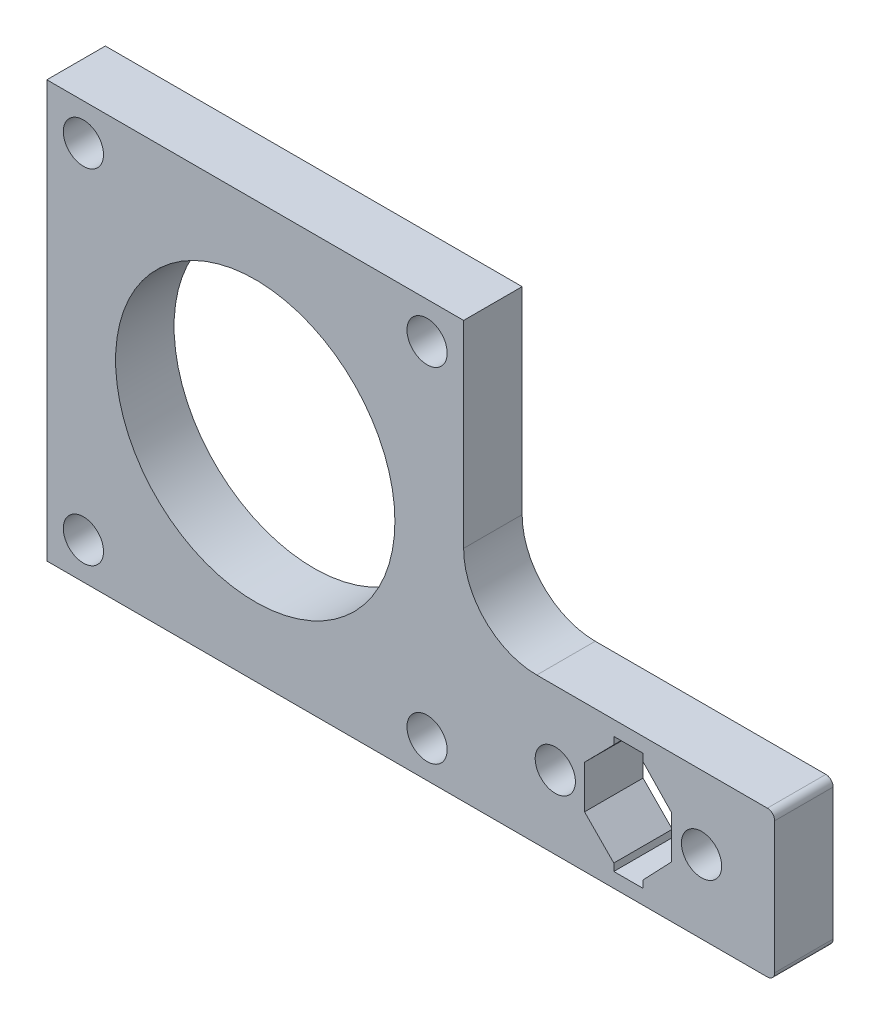
ISO-10303-21;
HEADER;
FILE_DESCRIPTION(('STEP AP214'),'2;1');
FILE_NAME('part.step','',(''),(''),'','','');
FILE_SCHEMA(('AUTOMOTIVE_DESIGN { 1 0 10303 214 1 1 1 1 }'));
ENDSEC;
DATA;
#1=APPLICATION_CONTEXT('core data for automotive mechanical design processes');
#2=APPLICATION_PROTOCOL_DEFINITION('international standard','automotive_design',2000,#1);
#3=PRODUCT_CONTEXT('',#1,'mechanical');
#4=PRODUCT('Part','Part','',(#3));
#5=PRODUCT_RELATED_PRODUCT_CATEGORY('part','',(#4));
#6=PRODUCT_DEFINITION_FORMATION('','',#4);
#7=PRODUCT_DEFINITION_CONTEXT('part definition',#1,'design');
#8=PRODUCT_DEFINITION('design','',#6,#7);
#9=PRODUCT_DEFINITION_SHAPE('','',#8);
#10=(LENGTH_UNIT() NAMED_UNIT(*) SI_UNIT(.MILLI.,.METRE.));
#11=(NAMED_UNIT(*) PLANE_ANGLE_UNIT() SI_UNIT($,.RADIAN.));
#12=(NAMED_UNIT(*) SI_UNIT($,.STERADIAN.) SOLID_ANGLE_UNIT());
#13=UNCERTAINTY_MEASURE_WITH_UNIT(LENGTH_MEASURE(1.E-05),#10,'distance_accuracy_value','');
#14=(GEOMETRIC_REPRESENTATION_CONTEXT(3) GLOBAL_UNCERTAINTY_ASSIGNED_CONTEXT((#13)) GLOBAL_UNIT_ASSIGNED_CONTEXT((#10,
#11,#12)) REPRESENTATION_CONTEXT('',''));
#15=CARTESIAN_POINT('',(0.,0.,0.));
#16=DIRECTION('',(0.,0.,1.));
#17=DIRECTION('',(1.,0.,0.));
#18=AXIS2_PLACEMENT_3D('',#15,#16,#17);
#19=CARTESIAN_POINT('',(14.9833392850546,-14.7619106256692,-8.));
#20=DIRECTION('',(0.712350865959975,-0.701823513261044,0.));
#21=DIRECTION('',(0.701823513261044,0.712350865959975,0.));
#22=AXIS2_PLACEMENT_3D('',#19,#20,#21);
#23=PLANE('',#22);
#24=DIRECTION('',(0.701823513261044,0.712350865959975,0.));
#25=VECTOR('',#24,1.);
#26=CARTESIAN_POINT('',(14.9833392850546,-14.7619106256692,0.));
#27=LINE('',#26,#25);
#28=CARTESIAN_POINT('',(-6.00000000000003,-36.0600000000001,0.));
#29=VERTEX_POINT('',#28);
#30=CARTESIAN_POINT('',(-2.,-32.,0.));
#31=VERTEX_POINT('',#30);
#32=EDGE_CURVE('E273',#29,#31,#27,.T.);
#33=ORIENTED_EDGE('',*,*,#32,.F.);
#34=DIRECTION('',(0.,0.,1.));
#35=VECTOR('',#34,1.);
#36=CARTESIAN_POINT('',(-6.00000000000003,-36.0600000000001,-8.));
#37=LINE('',#36,#35);
#38=CARTESIAN_POINT('',(-6.00000000000003,-36.0600000000001,-8.));
#39=VERTEX_POINT('',#38);
#40=EDGE_CURVE('E308',#39,#29,#37,.T.);
#41=ORIENTED_EDGE('',*,*,#40,.F.);
#42=DIRECTION('',(0.701823513261044,0.712350865959975,0.));
#43=VECTOR('',#42,1.);
#44=CARTESIAN_POINT('',(14.9833392850546,-14.7619106256692,-8.));
#45=LINE('',#44,#43);
#46=CARTESIAN_POINT('',(-2.,-32.,-8.));
#47=VERTEX_POINT('',#46);
#48=EDGE_CURVE('E220',#39,#47,#45,.T.);
#49=ORIENTED_EDGE('',*,*,#48,.T.);
#50=DIRECTION('',(0.,0.,1.));
#51=VECTOR('',#50,1.);
#52=CARTESIAN_POINT('',(-2.,-32.,-8.));
#53=LINE('',#52,#51);
#54=EDGE_CURVE('E331',#47,#31,#53,.T.);
#55=ORIENTED_EDGE('',*,*,#54,.T.);
#56=EDGE_LOOP('',(#33,#41,#49,#55));
#57=FACE_BOUND('',#56,.T.);
#58=ADVANCED_FACE('F35',(#57),#23,.T.);
#59=CARTESIAN_POINT('',(-6.00000000000011,0.,-8.));
#60=DIRECTION('',(1.,0.,0.));
#61=DIRECTION('',(0.,1.,0.));
#62=AXIS2_PLACEMENT_3D('',#59,#60,#61);
#63=PLANE('',#62);
#64=DIRECTION('',(0.,1.,0.));
#65=VECTOR('',#64,1.);
#66=CARTESIAN_POINT('',(-6.00000000000011,0.,0.));
#67=LINE('',#66,#65);
#68=CARTESIAN_POINT('',(-6.00000000000003,-41.9400000000002,0.));
#69=VERTEX_POINT('',#68);
#70=EDGE_CURVE('E208',#69,#29,#67,.T.);
#71=ORIENTED_EDGE('',*,*,#70,.F.);
#72=DIRECTION('',(0.,0.,1.));
#73=VECTOR('',#72,1.);
#74=CARTESIAN_POINT('',(-6.00000000000003,-41.9400000000002,-8.));
#75=LINE('',#74,#73);
#76=CARTESIAN_POINT('',(-6.00000000000003,-41.9400000000002,-8.));
#77=VERTEX_POINT('',#76);
#78=EDGE_CURVE('E311',#77,#69,#75,.T.);
#79=ORIENTED_EDGE('',*,*,#78,.F.);
#80=DIRECTION('',(0.,1.,0.));
#81=VECTOR('',#80,1.);
#82=CARTESIAN_POINT('',(-6.00000000000011,0.,-8.));
#83=LINE('',#82,#81);
#84=EDGE_CURVE('E200',#77,#39,#83,.T.);
#85=ORIENTED_EDGE('',*,*,#84,.T.);
#86=ORIENTED_EDGE('',*,*,#40,.T.);
#87=EDGE_LOOP('',(#71,#79,#85,#86));
#88=FACE_BOUND('',#87,.T.);
#89=ADVANCED_FACE('F389',(#88),#63,.T.);
#90=CARTESIAN_POINT('',(-24.0123385339063,-23.657476388086,-8.));
#91=DIRECTION('',(0.712350865959953,0.701823513261066,0.));
#92=DIRECTION('',(-0.701823513261066,0.712350865959953,0.));
#93=AXIS2_PLACEMENT_3D('',#90,#91,#92);
#94=PLANE('',#93);
#95=DIRECTION('',(-0.701823513261066,0.712350865959953,0.));
#96=VECTOR('',#95,1.);
#97=CARTESIAN_POINT('',(-24.0123385339063,-23.657476388086,0.));
#98=LINE('',#97,#96);
#99=CARTESIAN_POINT('',(-2.,-46.,0.));
#100=VERTEX_POINT('',#99);
#101=EDGE_CURVE('E303',#100,#69,#98,.T.);
#102=ORIENTED_EDGE('',*,*,#101,.F.);
#103=DIRECTION('',(0.,0.,1.));
#104=VECTOR('',#103,1.);
#105=CARTESIAN_POINT('',(-2.,-46.,-8.));
#106=LINE('',#105,#104);
#107=CARTESIAN_POINT('',(-2.,-46.,-8.));
#108=VERTEX_POINT('',#107);
#109=EDGE_CURVE('E313',#108,#100,#106,.T.);
#110=ORIENTED_EDGE('',*,*,#109,.F.);
#111=DIRECTION('',(-0.701823513261066,0.712350865959953,0.));
#112=VECTOR('',#111,1.);
#113=CARTESIAN_POINT('',(-24.0123385339063,-23.657476388086,-8.));
#114=LINE('',#113,#112);
#115=EDGE_CURVE('E250',#108,#77,#114,.T.);
#116=ORIENTED_EDGE('',*,*,#115,.T.);
#117=ORIENTED_EDGE('',*,*,#78,.T.);
#118=EDGE_LOOP('',(#102,#110,#116,#117));
#119=FACE_BOUND('',#118,.T.);
#120=ADVANCED_FACE('F395',(#119),#94,.T.);
#121=CARTESIAN_POINT('',(-2.,0.,-8.));
#122=DIRECTION('',(1.,0.,0.));
#123=DIRECTION('',(0.,0.,-1.));
#124=AXIS2_PLACEMENT_3D('',#121,#122,#123);
#125=PLANE('',#124);
#126=DIRECTION('',(0.,1.,0.));
#127=VECTOR('',#126,1.);
#128=CARTESIAN_POINT('',(-2.,0.,0.));
#129=LINE('',#128,#127);
#130=CARTESIAN_POINT('',(-2.,-47.,0.));
#131=VERTEX_POINT('',#130);
#132=EDGE_CURVE('E300',#131,#100,#129,.T.);
#133=ORIENTED_EDGE('',*,*,#132,.F.);
#134=DIRECTION('',(0.,0.,1.));
#135=VECTOR('',#134,1.);
#136=CARTESIAN_POINT('',(-2.,-47.,-8.));
#137=LINE('',#136,#135);
#138=CARTESIAN_POINT('',(-2.,-47.,-8.));
#139=VERTEX_POINT('',#138);
#140=EDGE_CURVE('E315',#139,#131,#137,.T.);
#141=ORIENTED_EDGE('',*,*,#140,.F.);
#142=DIRECTION('',(0.,1.,0.));
#143=VECTOR('',#142,1.);
#144=CARTESIAN_POINT('',(-2.,0.,-8.));
#145=LINE('',#144,#143);
#146=EDGE_CURVE('E247',#139,#108,#145,.T.);
#147=ORIENTED_EDGE('',*,*,#146,.T.);
#148=ORIENTED_EDGE('',*,*,#109,.T.);
#149=EDGE_LOOP('',(#133,#141,#147,#148));
#150=FACE_BOUND('',#149,.T.);
#151=ADVANCED_FACE('F524',(#150),#125,.T.);
#152=CARTESIAN_POINT('',(0.,-47.,-8.));
#153=DIRECTION('',(0.,1.,0.));
#154=DIRECTION('',(0.,0.,1.));
#155=AXIS2_PLACEMENT_3D('',#152,#153,#154);
#156=PLANE('',#155);
#157=DIRECTION('',(-1.,0.,0.));
#158=VECTOR('',#157,1.);
#159=CARTESIAN_POINT('',(0.,-47.,0.));
#160=LINE('',#159,#158);
#161=CARTESIAN_POINT('',(2.,-47.,0.));
#162=VERTEX_POINT('',#161);
#163=EDGE_CURVE('E297',#162,#131,#160,.T.);
#164=ORIENTED_EDGE('',*,*,#163,.F.);
#165=DIRECTION('',(0.,0.,1.));
#166=VECTOR('',#165,1.);
#167=CARTESIAN_POINT('',(2.,-47.,-8.));
#168=LINE('',#167,#166);
#169=CARTESIAN_POINT('',(2.,-47.,-8.));
#170=VERTEX_POINT('',#169);
#171=EDGE_CURVE('E317',#170,#162,#168,.T.);
#172=ORIENTED_EDGE('',*,*,#171,.F.);
#173=DIRECTION('',(-1.,0.,0.));
#174=VECTOR('',#173,1.);
#175=CARTESIAN_POINT('',(0.,-47.,-8.));
#176=LINE('',#175,#174);
#177=EDGE_CURVE('E244',#170,#139,#176,.T.);
#178=ORIENTED_EDGE('',*,*,#177,.T.);
#179=ORIENTED_EDGE('',*,*,#140,.T.);
#180=EDGE_LOOP('',(#164,#172,#178,#179));
#181=FACE_BOUND('',#180,.T.);
#182=ADVANCED_FACE('F528',(#181),#156,.T.);
#183=CARTESIAN_POINT('',(2.,0.,-8.));
#184=DIRECTION('',(-1.,0.,0.));
#185=DIRECTION('',(0.,0.,1.));
#186=AXIS2_PLACEMENT_3D('',#183,#184,#185);
#187=PLANE('',#186);
#188=DIRECTION('',(0.,-1.,0.));
#189=VECTOR('',#188,1.);
#190=CARTESIAN_POINT('',(2.,0.,0.));
#191=LINE('',#190,#189);
#192=CARTESIAN_POINT('',(2.,-46.,0.));
#193=VERTEX_POINT('',#192);
#194=EDGE_CURVE('E294',#193,#162,#191,.T.);
#195=ORIENTED_EDGE('',*,*,#194,.F.);
#196=DIRECTION('',(0.,0.,1.));
#197=VECTOR('',#196,1.);
#198=CARTESIAN_POINT('',(2.,-46.,-8.));
#199=LINE('',#198,#197);
#200=CARTESIAN_POINT('',(2.,-46.,-8.));
#201=VERTEX_POINT('',#200);
#202=EDGE_CURVE('E319',#201,#193,#199,.T.);
#203=ORIENTED_EDGE('',*,*,#202,.F.);
#204=DIRECTION('',(0.,-1.,0.));
#205=VECTOR('',#204,1.);
#206=CARTESIAN_POINT('',(2.,0.,-8.));
#207=LINE('',#206,#205);
#208=EDGE_CURVE('E241',#201,#170,#207,.T.);
#209=ORIENTED_EDGE('',*,*,#208,.T.);
#210=ORIENTED_EDGE('',*,*,#171,.T.);
#211=EDGE_LOOP('',(#195,#203,#209,#210));
#212=FACE_BOUND('',#211,.T.);
#213=ADVANCED_FACE('F532',(#212),#187,.T.);
#214=CARTESIAN_POINT('',(24.0216881222652,-22.9566871710317,-8.));
#215=DIRECTION('',(-0.722951160429626,0.690899138538656,0.));
#216=DIRECTION('',(-0.690899138538656,-0.722951160429626,0.));
#217=AXIS2_PLACEMENT_3D('',#214,#215,#216);
#218=PLANE('',#217);
#219=DIRECTION('',(-0.690899138538656,-0.722951160429626,0.));
#220=VECTOR('',#219,1.);
#221=CARTESIAN_POINT('',(24.0216881222652,-22.9566871710317,0.));
#222=LINE('',#221,#220);
#223=CARTESIAN_POINT('',(5.87999999999999,-41.94,0.));
#224=VERTEX_POINT('',#223);
#225=EDGE_CURVE('E291',#224,#193,#222,.T.);
#226=ORIENTED_EDGE('',*,*,#225,.F.);
#227=DIRECTION('',(0.,0.,1.));
#228=VECTOR('',#227,1.);
#229=CARTESIAN_POINT('',(5.87999999999999,-41.94,-8.));
#230=LINE('',#229,#228);
#231=CARTESIAN_POINT('',(5.87999999999999,-41.94,-8.));
#232=VERTEX_POINT('',#231);
#233=EDGE_CURVE('E321',#232,#224,#230,.T.);
#234=ORIENTED_EDGE('',*,*,#233,.F.);
#235=DIRECTION('',(-0.690899138538656,-0.722951160429626,0.));
#236=VECTOR('',#235,1.);
#237=CARTESIAN_POINT('',(24.0216881222652,-22.9566871710317,-8.));
#238=LINE('',#237,#236);
#239=EDGE_CURVE('E238',#232,#201,#238,.T.);
#240=ORIENTED_EDGE('',*,*,#239,.T.);
#241=ORIENTED_EDGE('',*,*,#202,.T.);
#242=EDGE_LOOP('',(#226,#234,#240,#241));
#243=FACE_BOUND('',#242,.T.);
#244=ADVANCED_FACE('F536',(#243),#218,.T.);
#245=CARTESIAN_POINT('',(5.87999999999999,0.,-8.));
#246=DIRECTION('',(-1.,0.,0.));
#247=DIRECTION('',(0.,0.,1.));
#248=AXIS2_PLACEMENT_3D('',#245,#246,#247);
#249=PLANE('',#248);
#250=DIRECTION('',(0.,-1.,0.));
#251=VECTOR('',#250,1.);
#252=CARTESIAN_POINT('',(5.87999999999999,0.,0.));
#253=LINE('',#252,#251);
#254=CARTESIAN_POINT('',(5.87999999999999,-36.06,0.));
#255=VERTEX_POINT('',#254);
#256=EDGE_CURVE('E288',#255,#224,#253,.T.);
#257=ORIENTED_EDGE('',*,*,#256,.F.);
#258=DIRECTION('',(0.,0.,1.));
#259=VECTOR('',#258,1.);
#260=CARTESIAN_POINT('',(5.87999999999999,-36.06,-8.));
#261=LINE('',#260,#259);
#262=CARTESIAN_POINT('',(5.87999999999999,-36.06,-8.));
#263=VERTEX_POINT('',#262);
#264=EDGE_CURVE('E323',#263,#255,#261,.T.);
#265=ORIENTED_EDGE('',*,*,#264,.F.);
#266=DIRECTION('',(0.,-1.,0.));
#267=VECTOR('',#266,1.);
#268=CARTESIAN_POINT('',(5.87999999999999,0.,-8.));
#269=LINE('',#268,#267);
#270=EDGE_CURVE('E235',#263,#232,#269,.T.);
#271=ORIENTED_EDGE('',*,*,#270,.T.);
#272=ORIENTED_EDGE('',*,*,#233,.T.);
#273=EDGE_LOOP('',(#257,#265,#271,#272));
#274=FACE_BOUND('',#273,.T.);
#275=ADVANCED_FACE('F540',(#274),#249,.T.);
#276=CARTESIAN_POINT('',(-14.9382459255501,-14.2759591603779,-8.));
#277=DIRECTION('',(-0.722951160429626,-0.690899138538656,0.));
#278=DIRECTION('',(0.690899138538656,-0.722951160429626,0.));
#279=AXIS2_PLACEMENT_3D('',#276,#277,#278);
#280=PLANE('',#279);
#281=DIRECTION('',(0.690899138538656,-0.722951160429626,0.));
#282=VECTOR('',#281,1.);
#283=CARTESIAN_POINT('',(-14.9382459255501,-14.2759591603779,0.));
#284=LINE('',#283,#282);
#285=CARTESIAN_POINT('',(2.,-32.,0.));
#286=VERTEX_POINT('',#285);
#287=EDGE_CURVE('E285',#286,#255,#284,.T.);
#288=ORIENTED_EDGE('',*,*,#287,.F.);
#289=DIRECTION('',(0.,0.,1.));
#290=VECTOR('',#289,1.);
#291=CARTESIAN_POINT('',(2.,-32.,-8.));
#292=LINE('',#291,#290);
#293=CARTESIAN_POINT('',(2.,-32.,-8.));
#294=VERTEX_POINT('',#293);
#295=EDGE_CURVE('E325',#294,#286,#292,.T.);
#296=ORIENTED_EDGE('',*,*,#295,.F.);
#297=DIRECTION('',(0.690899138538656,-0.722951160429626,0.));
#298=VECTOR('',#297,1.);
#299=CARTESIAN_POINT('',(-14.9382459255501,-14.2759591603779,-8.));
#300=LINE('',#299,#298);
#301=EDGE_CURVE('E232',#294,#263,#300,.T.);
#302=ORIENTED_EDGE('',*,*,#301,.T.);
#303=ORIENTED_EDGE('',*,*,#264,.T.);
#304=EDGE_LOOP('',(#288,#296,#302,#303));
#305=FACE_BOUND('',#304,.T.);
#306=ADVANCED_FACE('F544',(#305),#280,.T.);
#307=CARTESIAN_POINT('',(2.,0.,-8.));
#308=DIRECTION('',(-1.,0.,0.));
#309=DIRECTION('',(0.,0.,1.));
#310=AXIS2_PLACEMENT_3D('',#307,#308,#309);
#311=PLANE('',#310);
#312=DIRECTION('',(0.,-1.,0.));
#313=VECTOR('',#312,1.);
#314=CARTESIAN_POINT('',(2.,0.,0.));
#315=LINE('',#314,#313);
#316=CARTESIAN_POINT('',(2.,-31.,0.));
#317=VERTEX_POINT('',#316);
#318=EDGE_CURVE('E282',#317,#286,#315,.T.);
#319=ORIENTED_EDGE('',*,*,#318,.F.);
#320=DIRECTION('',(0.,0.,1.));
#321=VECTOR('',#320,1.);
#322=CARTESIAN_POINT('',(2.,-31.,-8.));
#323=LINE('',#322,#321);
#324=CARTESIAN_POINT('',(2.,-31.,-8.));
#325=VERTEX_POINT('',#324);
#326=EDGE_CURVE('E327',#325,#317,#323,.T.);
#327=ORIENTED_EDGE('',*,*,#326,.F.);
#328=DIRECTION('',(0.,-1.,0.));
#329=VECTOR('',#328,1.);
#330=CARTESIAN_POINT('',(2.,0.,-8.));
#331=LINE('',#330,#329);
#332=EDGE_CURVE('E229',#325,#294,#331,.T.);
#333=ORIENTED_EDGE('',*,*,#332,.T.);
#334=ORIENTED_EDGE('',*,*,#295,.T.);
#335=EDGE_LOOP('',(#319,#327,#333,#334));
#336=FACE_BOUND('',#335,.T.);
#337=ADVANCED_FACE('F548',(#336),#311,.T.);
#338=CARTESIAN_POINT('',(0.,-31.,-8.));
#339=DIRECTION('',(0.,-1.,0.));
#340=DIRECTION('',(0.,0.,-1.));
#341=AXIS2_PLACEMENT_3D('',#338,#339,#340);
#342=PLANE('',#341);
#343=DIRECTION('',(1.,0.,0.));
#344=VECTOR('',#343,1.);
#345=CARTESIAN_POINT('',(0.,-31.,0.));
#346=LINE('',#345,#344);
#347=CARTESIAN_POINT('',(-2.,-31.,0.));
#348=VERTEX_POINT('',#347);
#349=EDGE_CURVE('E279',#348,#317,#346,.T.);
#350=ORIENTED_EDGE('',*,*,#349,.F.);
#351=DIRECTION('',(0.,0.,1.));
#352=VECTOR('',#351,1.);
#353=CARTESIAN_POINT('',(-2.,-31.,-8.));
#354=LINE('',#353,#352);
#355=CARTESIAN_POINT('',(-2.,-31.,-8.));
#356=VERTEX_POINT('',#355);
#357=EDGE_CURVE('E329',#356,#348,#354,.T.);
#358=ORIENTED_EDGE('',*,*,#357,.F.);
#359=DIRECTION('',(1.,0.,0.));
#360=VECTOR('',#359,1.);
#361=CARTESIAN_POINT('',(0.,-31.,-8.));
#362=LINE('',#361,#360);
#363=EDGE_CURVE('E226',#356,#325,#362,.T.);
#364=ORIENTED_EDGE('',*,*,#363,.T.);
#365=ORIENTED_EDGE('',*,*,#326,.T.);
#366=EDGE_LOOP('',(#350,#358,#364,#365));
#367=FACE_BOUND('',#366,.T.);
#368=ADVANCED_FACE('F551',(#367),#342,.T.);
#369=CARTESIAN_POINT('',(-22.5367514640186,0.,-8.));
#370=DIRECTION('',(-1.,0.,0.));
#371=DIRECTION('',(0.,0.,1.));
#372=AXIS2_PLACEMENT_3D('',#369,#370,#371);
#373=PLANE('',#372);
#374=DIRECTION('',(0.,-1.,0.));
#375=VECTOR('',#374,1.);
#376=CARTESIAN_POINT('',(-22.5367514640186,0.,0.));
#377=LINE('',#376,#375);
#378=CARTESIAN_POINT('',(-22.5367514640186,7.99999999999999,0.));
#379=VERTEX_POINT('',#378);
#380=CARTESIAN_POINT('',(-22.5367514640186,-19.,0.));
#381=VERTEX_POINT('',#380);
#382=EDGE_CURVE('E258',#379,#381,#377,.T.);
#383=ORIENTED_EDGE('',*,*,#382,.T.);
#384=DIRECTION('',(0.,0.,1.));
#385=VECTOR('',#384,1.);
#386=CARTESIAN_POINT('',(-22.5367514640186,-19.,-8.));
#387=LINE('',#386,#385);
#388=CARTESIAN_POINT('',(-22.5367514640186,-19.,-8.));
#389=VERTEX_POINT('',#388);
#390=EDGE_CURVE('E204',#381,#389,#387,.F.);
#391=ORIENTED_EDGE('',*,*,#390,.T.);
#392=DIRECTION('',(0.,-1.,0.));
#393=VECTOR('',#392,1.);
#394=CARTESIAN_POINT('',(-22.5367514640186,0.,-8.));
#395=LINE('',#394,#393);
#396=CARTESIAN_POINT('',(-22.5367514640186,7.99999999999999,-8.));
#397=VERTEX_POINT('',#396);
#398=EDGE_CURVE('E184',#397,#389,#395,.T.);
#399=ORIENTED_EDGE('',*,*,#398,.F.);
#400=DIRECTION('',(0.,0.,1.));
#401=VECTOR('',#400,1.);
#402=CARTESIAN_POINT('',(-22.5367514640186,7.99999999999999,-8.));
#403=LINE('',#402,#401);
#404=EDGE_CURVE('E192',#397,#379,#403,.T.);
#405=ORIENTED_EDGE('',*,*,#404,.T.);
#406=EDGE_LOOP('',(#383,#391,#399,#405));
#407=FACE_BOUND('',#406,.T.);
#408=ADVANCED_FACE('F202',(#407),#373,.F.);
#409=CARTESIAN_POINT('',(0.,-29.,-8.));
#410=DIRECTION('',(0.,1.,0.));
#411=DIRECTION('',(-1.,0.,0.));
#412=AXIS2_PLACEMENT_3D('',#409,#410,#411);
#413=PLANE('',#412);
#414=DIRECTION('',(-1.,0.,0.));
#415=VECTOR('',#414,1.);
#416=CARTESIAN_POINT('',(0.,-29.,0.));
#417=LINE('',#416,#415);
#418=CARTESIAN_POINT('',(19.,-29.,0.));
#419=VERTEX_POINT('',#418);
#420=CARTESIAN_POINT('',(-12.5367514640185,-29.,0.));
#421=VERTEX_POINT('',#420);
#422=EDGE_CURVE('E271',#419,#421,#417,.T.);
#423=ORIENTED_EDGE('',*,*,#422,.F.);
#424=DIRECTION('',(0.,0.,1.));
#425=VECTOR('',#424,1.);
#426=CARTESIAN_POINT('',(19.,-29.,-8.));
#427=LINE('',#426,#425);
#428=CARTESIAN_POINT('',(19.,-29.,-8.));
#429=VERTEX_POINT('',#428);
#430=EDGE_CURVE('E11',#419,#429,#427,.F.);
#431=ORIENTED_EDGE('',*,*,#430,.T.);
#432=DIRECTION('',(-1.,0.,0.));
#433=VECTOR('',#432,1.);
#434=CARTESIAN_POINT('',(0.,-29.,-8.));
#435=LINE('',#434,#433);
#436=CARTESIAN_POINT('',(-12.5367514640185,-29.,-8.));
#437=VERTEX_POINT('',#436);
#438=EDGE_CURVE('E218',#429,#437,#435,.T.);
#439=ORIENTED_EDGE('',*,*,#438,.T.);
#440=DIRECTION('',(0.,0.,1.));
#441=VECTOR('',#440,1.);
#442=CARTESIAN_POINT('',(-12.5367514640185,-29.,-8.));
#443=LINE('',#442,#441);
#444=EDGE_CURVE('E310',#437,#421,#443,.T.);
#445=ORIENTED_EDGE('',*,*,#444,.T.);
#446=EDGE_LOOP('',(#423,#431,#439,#445));
#447=FACE_BOUND('',#446,.T.);
#448=ADVANCED_FACE('F372',(#447),#413,.T.);
#449=CARTESIAN_POINT('',(20.,0.,-8.));
#450=DIRECTION('',(1.,0.,0.));
#451=DIRECTION('',(0.,0.,-1.));
#452=AXIS2_PLACEMENT_3D('',#449,#450,#451);
#453=PLANE('',#452);
#454=DIRECTION('',(0.,1.,0.));
#455=VECTOR('',#454,1.);
#456=CARTESIAN_POINT('',(20.,0.,0.));
#457=LINE('',#456,#455);
#458=CARTESIAN_POINT('',(20.,-48.,0.));
#459=VERTEX_POINT('',#458);
#460=CARTESIAN_POINT('',(20.,-30.,0.));
#461=VERTEX_POINT('',#460);
#462=EDGE_CURVE('E268',#459,#461,#457,.T.);
#463=ORIENTED_EDGE('',*,*,#462,.F.);
#464=DIRECTION('',(0.,0.,1.));
#465=VECTOR('',#464,1.);
#466=CARTESIAN_POINT('',(20.,-48.,-8.));
#467=LINE('',#466,#465);
#468=CARTESIAN_POINT('',(20.,-48.,-8.));
#469=VERTEX_POINT('',#468);
#470=EDGE_CURVE('E353',#459,#469,#467,.F.);
#471=ORIENTED_EDGE('',*,*,#470,.T.);
#472=DIRECTION('',(0.,1.,0.));
#473=VECTOR('',#472,1.);
#474=CARTESIAN_POINT('',(20.,0.,-8.));
#475=LINE('',#474,#473);
#476=CARTESIAN_POINT('',(20.,-30.,-8.));
#477=VERTEX_POINT('',#476);
#478=EDGE_CURVE('E216',#469,#477,#475,.T.);
#479=ORIENTED_EDGE('',*,*,#478,.T.);
#480=DIRECTION('',(0.,0.,1.));
#481=VECTOR('',#480,1.);
#482=CARTESIAN_POINT('',(20.,-30.,-8.));
#483=LINE('',#482,#481);
#484=EDGE_CURVE('E350',#477,#461,#483,.T.);
#485=ORIENTED_EDGE('',*,*,#484,.T.);
#486=EDGE_LOOP('',(#463,#471,#479,#485));
#487=FACE_BOUND('',#486,.T.);
#488=ADVANCED_FACE('F368',(#487),#453,.T.);
#489=CARTESIAN_POINT('',(0.,-49.,-8.));
#490=DIRECTION('',(0.,-1.,0.));
#491=DIRECTION('',(0.,0.,-1.));
#492=AXIS2_PLACEMENT_3D('',#489,#490,#491);
#493=PLANE('',#492);
#494=DIRECTION('',(1.,0.,0.));
#495=VECTOR('',#494,1.);
#496=CARTESIAN_POINT('',(0.,-49.,-8.));
#497=LINE('',#496,#495);
#498=CARTESIAN_POINT('',(-79.5367514640186,-49.,-8.));
#499=VERTEX_POINT('',#498);
#500=CARTESIAN_POINT('',(19.,-49.,-8.));
#501=VERTEX_POINT('',#500);
#502=EDGE_CURVE('E213',#499,#501,#497,.T.);
#503=ORIENTED_EDGE('',*,*,#502,.T.);
#504=DIRECTION('',(0.,0.,1.));
#505=VECTOR('',#504,1.);
#506=CARTESIAN_POINT('',(19.,-49.,-8.));
#507=LINE('',#506,#505);
#508=CARTESIAN_POINT('',(19.,-49.,0.));
#509=VERTEX_POINT('',#508);
#510=EDGE_CURVE('E343',#501,#509,#507,.T.);
#511=ORIENTED_EDGE('',*,*,#510,.T.);
#512=DIRECTION('',(1.,0.,0.));
#513=VECTOR('',#512,1.);
#514=CARTESIAN_POINT('',(0.,-49.,0.));
#515=LINE('',#514,#513);
#516=CARTESIAN_POINT('',(-79.5367514640186,-49.,0.));
#517=VERTEX_POINT('',#516);
#518=EDGE_CURVE('E265',#517,#509,#515,.T.);
#519=ORIENTED_EDGE('',*,*,#518,.F.);
#520=DIRECTION('',(0.,0.,1.));
#521=VECTOR('',#520,1.);
#522=CARTESIAN_POINT('',(-79.5367514640186,-49.,-8.));
#523=LINE('',#522,#521);
#524=EDGE_CURVE('E333',#499,#517,#523,.T.);
#525=ORIENTED_EDGE('',*,*,#524,.F.);
#526=EDGE_LOOP('',(#503,#511,#519,#525));
#527=FACE_BOUND('',#526,.T.);
#528=ADVANCED_FACE('F360',(#527),#493,.T.);
#529=CARTESIAN_POINT('',(-79.5367514640186,0.,-8.));
#530=DIRECTION('',(-1.,0.,0.));
#531=DIRECTION('',(0.,0.,1.));
#532=AXIS2_PLACEMENT_3D('',#529,#530,#531);
#533=PLANE('',#532);
#534=DIRECTION('',(0.,-1.,0.));
#535=VECTOR('',#534,1.);
#536=CARTESIAN_POINT('',(-79.5367514640186,0.,0.));
#537=LINE('',#536,#535);
#538=CARTESIAN_POINT('',(-79.5367514640186,7.99999999999999,0.));
#539=VERTEX_POINT('',#538);
#540=EDGE_CURVE('E262',#539,#517,#537,.T.);
#541=ORIENTED_EDGE('',*,*,#540,.F.);
#542=DIRECTION('',(0.,0.,1.));
#543=VECTOR('',#542,1.);
#544=CARTESIAN_POINT('',(-79.5367514640186,7.99999999999999,-8.));
#545=LINE('',#544,#543);
#546=CARTESIAN_POINT('',(-79.5367514640186,7.99999999999999,-8.));
#547=VERTEX_POINT('',#546);
#548=EDGE_CURVE('E199',#547,#539,#545,.T.);
#549=ORIENTED_EDGE('',*,*,#548,.F.);
#550=DIRECTION('',(0.,-1.,0.));
#551=VECTOR('',#550,1.);
#552=CARTESIAN_POINT('',(-79.5367514640186,0.,-8.));
#553=LINE('',#552,#551);
#554=EDGE_CURVE('E188',#547,#499,#553,.T.);
#555=ORIENTED_EDGE('',*,*,#554,.T.);
#556=ORIENTED_EDGE('',*,*,#524,.T.);
#557=EDGE_LOOP('',(#541,#549,#555,#556));
#558=FACE_BOUND('',#557,.T.);
#559=ADVANCED_FACE('F378',(#558),#533,.T.);
#560=CARTESIAN_POINT('',(0.,7.99999999999999,-8.));
#561=DIRECTION('',(0.,-1.,0.));
#562=DIRECTION('',(0.,0.,-1.));
#563=AXIS2_PLACEMENT_3D('',#560,#561,#562);
#564=PLANE('',#563);
#565=DIRECTION('',(1.,0.,0.));
#566=VECTOR('',#565,1.);
#567=CARTESIAN_POINT('',(0.,7.99999999999999,0.));
#568=LINE('',#567,#566);
#569=EDGE_CURVE('E195',#539,#379,#568,.T.);
#570=ORIENTED_EDGE('',*,*,#569,.T.);
#571=ORIENTED_EDGE('',*,*,#404,.F.);
#572=DIRECTION('',(1.,0.,0.));
#573=VECTOR('',#572,1.);
#574=CARTESIAN_POINT('',(0.,7.99999999999999,-8.));
#575=LINE('',#574,#573);
#576=EDGE_CURVE('E178',#547,#397,#575,.T.);
#577=ORIENTED_EDGE('',*,*,#576,.F.);
#578=ORIENTED_EDGE('',*,*,#548,.T.);
#579=EDGE_LOOP('',(#570,#571,#577,#578));
#580=FACE_BOUND('',#579,.T.);
#581=ADVANCED_FACE('F193',(#580),#564,.F.);
#582=CARTESIAN_POINT('',(-51.0367514640186,-20.5,-8.));
#583=DIRECTION('',(0.,0.,1.));
#584=DIRECTION('',(1.,0.,0.));
#585=AXIS2_PLACEMENT_3D('',#582,#583,#584);
#586=CYLINDRICAL_SURFACE('',#585,19.1);
#587=CARTESIAN_POINT('',(-51.0367514640186,-20.5,-8.));
#588=DIRECTION('',(0.,0.,1.));
#589=DIRECTION('',(1.,0.,0.));
#590=AXIS2_PLACEMENT_3D('',#587,#588,#589);
#591=CIRCLE('',#590,19.1);
#592=CARTESIAN_POINT('',(-31.9367514640186,-20.5,-8.));
#593=VERTEX_POINT('',#592);
#594=EDGE_CURVE('E205',#593,#593,#591,.T.);
#595=ORIENTED_EDGE('',*,*,#594,.F.);
#596=EDGE_LOOP('',(#595));
#597=FACE_BOUND('',#596,.T.);
#598=CARTESIAN_POINT('',(-51.0367514640186,-20.5,0.));
#599=DIRECTION('',(0.,0.,1.));
#600=DIRECTION('',(1.,0.,0.));
#601=AXIS2_PLACEMENT_3D('',#598,#599,#600);
#602=CIRCLE('',#601,19.1);
#603=CARTESIAN_POINT('',(-31.9367514640186,-20.5,0.));
#604=VERTEX_POINT('',#603);
#605=EDGE_CURVE('E255',#604,#604,#602,.T.);
#606=ORIENTED_EDGE('',*,*,#605,.T.);
#607=EDGE_LOOP('',(#606));
#608=FACE_BOUND('',#607,.T.);
#609=ADVANCED_FACE('F385',(#597,#608),#586,.F.);
#610=CARTESIAN_POINT('',(-2.,0.,-8.));
#611=DIRECTION('',(1.,0.,0.));
#612=DIRECTION('',(0.,0.,-1.));
#613=AXIS2_PLACEMENT_3D('',#610,#611,#612);
#614=PLANE('',#613);
#615=DIRECTION('',(0.,1.,0.));
#616=VECTOR('',#615,1.);
#617=CARTESIAN_POINT('',(-2.,0.,0.));
#618=LINE('',#617,#616);
#619=EDGE_CURVE('E276',#31,#348,#618,.T.);
#620=ORIENTED_EDGE('',*,*,#619,.F.);
#621=ORIENTED_EDGE('',*,*,#54,.F.);
#622=DIRECTION('',(0.,1.,0.));
#623=VECTOR('',#622,1.);
#624=CARTESIAN_POINT('',(-2.,0.,-8.));
#625=LINE('',#624,#623);
#626=EDGE_CURVE('E223',#47,#356,#625,.T.);
#627=ORIENTED_EDGE('',*,*,#626,.T.);
#628=ORIENTED_EDGE('',*,*,#357,.T.);
#629=EDGE_LOOP('',(#620,#621,#627,#628));
#630=FACE_BOUND('',#629,.T.);
#631=ADVANCED_FACE('F401',(#630),#614,.T.);
#632=CARTESIAN_POINT('',(0.,0.,-8.));
#633=DIRECTION('',(0.,0.,1.));
#634=DIRECTION('',(1.,0.,0.));
#635=AXIS2_PLACEMENT_3D('',#632,#633,#634);
#636=PLANE('',#635);
#637=CARTESIAN_POINT('',(-74.5367514640186,3.,-8.));
#638=DIRECTION('',(0.,0.,1.));
#639=DIRECTION('',(1.,0.,0.));
#640=AXIS2_PLACEMENT_3D('',#637,#638,#639);
#641=CIRCLE('',#640,2.75);
#642=CARTESIAN_POINT('',(-71.7867514640186,3.,-8.));
#643=VERTEX_POINT('',#642);
#644=EDGE_CURVE('E705',#643,#643,#641,.T.);
#645=ORIENTED_EDGE('',*,*,#644,.T.);
#646=EDGE_LOOP('',(#645));
#647=FACE_BOUND('',#646,.T.);
#648=CARTESIAN_POINT('',(-74.5367514640186,-44.,-8.));
#649=DIRECTION('',(0.,0.,1.));
#650=DIRECTION('',(1.,0.,0.));
#651=AXIS2_PLACEMENT_3D('',#648,#649,#650);
#652=CIRCLE('',#651,2.75);
#653=CARTESIAN_POINT('',(-71.7867514640186,-44.,-8.));
#654=VERTEX_POINT('',#653);
#655=EDGE_CURVE('E715',#654,#654,#652,.T.);
#656=ORIENTED_EDGE('',*,*,#655,.T.);
#657=EDGE_LOOP('',(#656));
#658=FACE_BOUND('',#657,.T.);
#659=CARTESIAN_POINT('',(-27.5367514640186,-44.,-8.));
#660=DIRECTION('',(0.,0.,1.));
#661=DIRECTION('',(1.,0.,0.));
#662=AXIS2_PLACEMENT_3D('',#659,#660,#661);
#663=CIRCLE('',#662,2.75);
#664=CARTESIAN_POINT('',(-24.7867514640186,-44.,-8.));
#665=VERTEX_POINT('',#664);
#666=EDGE_CURVE('E721',#665,#665,#663,.T.);
#667=ORIENTED_EDGE('',*,*,#666,.T.);
#668=EDGE_LOOP('',(#667));
#669=FACE_BOUND('',#668,.T.);
#670=CARTESIAN_POINT('',(-27.5367514640186,3.,-8.));
#671=DIRECTION('',(0.,0.,1.));
#672=DIRECTION('',(1.,0.,0.));
#673=AXIS2_PLACEMENT_3D('',#670,#671,#672);
#674=CIRCLE('',#673,2.75);
#675=CARTESIAN_POINT('',(-24.7867514640186,3.,-8.));
#676=VERTEX_POINT('',#675);
#677=EDGE_CURVE('E727',#676,#676,#674,.T.);
#678=ORIENTED_EDGE('',*,*,#677,.T.);
#679=EDGE_LOOP('',(#678));
#680=FACE_BOUND('',#679,.T.);
#681=CARTESIAN_POINT('',(-10.,-39.,-8.));
#682=DIRECTION('',(0.,0.,1.));
#683=DIRECTION('',(1.,0.,0.));
#684=AXIS2_PLACEMENT_3D('',#681,#682,#683);
#685=CIRCLE('',#684,2.75);
#686=CARTESIAN_POINT('',(-7.25000000000001,-39.,-8.));
#687=VERTEX_POINT('',#686);
#688=EDGE_CURVE('E733',#687,#687,#685,.T.);
#689=ORIENTED_EDGE('',*,*,#688,.T.);
#690=EDGE_LOOP('',(#689));
#691=FACE_BOUND('',#690,.T.);
#692=CARTESIAN_POINT('',(9.99999999999999,-39.,-8.));
#693=DIRECTION('',(0.,0.,1.));
#694=DIRECTION('',(1.,0.,0.));
#695=AXIS2_PLACEMENT_3D('',#692,#693,#694);
#696=CIRCLE('',#695,2.75);
#697=CARTESIAN_POINT('',(12.75,-39.,-8.));
#698=VERTEX_POINT('',#697);
#699=EDGE_CURVE('E259',#698,#698,#696,.T.);
#700=ORIENTED_EDGE('',*,*,#699,.T.);
#701=EDGE_LOOP('',(#700));
#702=FACE_BOUND('',#701,.T.);
#703=ORIENTED_EDGE('',*,*,#594,.T.);
#704=EDGE_LOOP('',(#703));
#705=FACE_BOUND('',#704,.T.);
#706=ORIENTED_EDGE('',*,*,#478,.F.);
#707=CARTESIAN_POINT('',(19.,-48.,-8.));
#708=DIRECTION('',(0.,0.,1.));
#709=DIRECTION('',(1.,0.,0.));
#710=AXIS2_PLACEMENT_3D('',#707,#708,#709);
#711=CIRCLE('',#710,1.);
#712=EDGE_CURVE('E43',#469,#501,#711,.F.);
#713=ORIENTED_EDGE('',*,*,#712,.T.);
#714=ORIENTED_EDGE('',*,*,#502,.F.);
#715=ORIENTED_EDGE('',*,*,#554,.F.);
#716=ORIENTED_EDGE('',*,*,#576,.T.);
#717=ORIENTED_EDGE('',*,*,#398,.T.);
#718=CARTESIAN_POINT('',(-12.5367514640186,-19.,-8.));
#719=DIRECTION('',(0.,0.,1.));
#720=DIRECTION('',(1.,0.,0.));
#721=AXIS2_PLACEMENT_3D('',#718,#719,#720);
#722=CIRCLE('',#721,10.);
#723=EDGE_CURVE('E341',#389,#437,#722,.T.);
#724=ORIENTED_EDGE('',*,*,#723,.T.);
#725=ORIENTED_EDGE('',*,*,#438,.F.);
#726=CARTESIAN_POINT('',(19.,-30.,-8.));
#727=DIRECTION('',(0.,0.,1.));
#728=DIRECTION('',(1.,0.,0.));
#729=AXIS2_PLACEMENT_3D('',#726,#727,#728);
#730=CIRCLE('',#729,1.);
#731=EDGE_CURVE('E55',#429,#477,#730,.F.);
#732=ORIENTED_EDGE('',*,*,#731,.T.);
#733=EDGE_LOOP('',(#706,#713,#714,#715,#716,#717,#724,#725,#732));
#734=FACE_BOUND('',#733,.T.);
#735=ORIENTED_EDGE('',*,*,#48,.F.);
#736=ORIENTED_EDGE('',*,*,#84,.F.);
#737=ORIENTED_EDGE('',*,*,#115,.F.);
#738=ORIENTED_EDGE('',*,*,#146,.F.);
#739=ORIENTED_EDGE('',*,*,#177,.F.);
#740=ORIENTED_EDGE('',*,*,#208,.F.);
#741=ORIENTED_EDGE('',*,*,#239,.F.);
#742=ORIENTED_EDGE('',*,*,#270,.F.);
#743=ORIENTED_EDGE('',*,*,#301,.F.);
#744=ORIENTED_EDGE('',*,*,#332,.F.);
#745=ORIENTED_EDGE('',*,*,#363,.F.);
#746=ORIENTED_EDGE('',*,*,#626,.F.);
#747=EDGE_LOOP('',(#735,#736,#737,#738,#739,#740,#741,#742,#743,#744,#745,#746));
#748=FACE_BOUND('',#747,.T.);
#749=ADVANCED_FACE('F180',(#647,#658,#669,#680,#691,#702,#705,#734,#748),#636,.F.);
#750=CARTESIAN_POINT('',(0.,0.,0.));
#751=DIRECTION('',(0.,0.,1.));
#752=DIRECTION('',(1.,0.,0.));
#753=AXIS2_PLACEMENT_3D('',#750,#751,#752);
#754=PLANE('',#753);
#755=CARTESIAN_POINT('',(-74.5367514640186,3.,0.));
#756=DIRECTION('',(0.,0.,1.));
#757=DIRECTION('',(1.,0.,0.));
#758=AXIS2_PLACEMENT_3D('',#755,#756,#757);
#759=CIRCLE('',#758,2.75);
#760=CARTESIAN_POINT('',(-71.7867514640186,3.,0.));
#761=VERTEX_POINT('',#760);
#762=EDGE_CURVE('E708',#761,#761,#759,.T.);
#763=ORIENTED_EDGE('',*,*,#762,.F.);
#764=EDGE_LOOP('',(#763));
#765=FACE_BOUND('',#764,.T.);
#766=CARTESIAN_POINT('',(-74.5367514640186,-44.,0.));
#767=DIRECTION('',(0.,0.,1.));
#768=DIRECTION('',(1.,0.,0.));
#769=AXIS2_PLACEMENT_3D('',#766,#767,#768);
#770=CIRCLE('',#769,2.75);
#771=CARTESIAN_POINT('',(-71.7867514640186,-44.,0.));
#772=VERTEX_POINT('',#771);
#773=EDGE_CURVE('E710',#772,#772,#770,.T.);
#774=ORIENTED_EDGE('',*,*,#773,.F.);
#775=EDGE_LOOP('',(#774));
#776=FACE_BOUND('',#775,.T.);
#777=CARTESIAN_POINT('',(-27.5367514640186,-44.,0.));
#778=DIRECTION('',(0.,0.,1.));
#779=DIRECTION('',(1.,0.,0.));
#780=AXIS2_PLACEMENT_3D('',#777,#778,#779);
#781=CIRCLE('',#780,2.75);
#782=CARTESIAN_POINT('',(-24.7867514640186,-44.,0.));
#783=VERTEX_POINT('',#782);
#784=EDGE_CURVE('E718',#783,#783,#781,.T.);
#785=ORIENTED_EDGE('',*,*,#784,.F.);
#786=EDGE_LOOP('',(#785));
#787=FACE_BOUND('',#786,.T.);
#788=CARTESIAN_POINT('',(-27.5367514640186,3.,0.));
#789=DIRECTION('',(0.,0.,1.));
#790=DIRECTION('',(1.,0.,0.));
#791=AXIS2_PLACEMENT_3D('',#788,#789,#790);
#792=CIRCLE('',#791,2.75);
#793=CARTESIAN_POINT('',(-24.7867514640186,3.,0.));
#794=VERTEX_POINT('',#793);
#795=EDGE_CURVE('E724',#794,#794,#792,.T.);
#796=ORIENTED_EDGE('',*,*,#795,.F.);
#797=EDGE_LOOP('',(#796));
#798=FACE_BOUND('',#797,.T.);
#799=CARTESIAN_POINT('',(-10.,-39.,0.));
#800=DIRECTION('',(0.,0.,1.));
#801=DIRECTION('',(1.,0.,0.));
#802=AXIS2_PLACEMENT_3D('',#799,#800,#801);
#803=CIRCLE('',#802,2.75);
#804=CARTESIAN_POINT('',(-7.25000000000001,-39.,0.));
#805=VERTEX_POINT('',#804);
#806=EDGE_CURVE('E730',#805,#805,#803,.T.);
#807=ORIENTED_EDGE('',*,*,#806,.F.);
#808=EDGE_LOOP('',(#807));
#809=FACE_BOUND('',#808,.T.);
#810=CARTESIAN_POINT('',(9.99999999999999,-39.,0.));
#811=DIRECTION('',(0.,0.,1.));
#812=DIRECTION('',(1.,0.,0.));
#813=AXIS2_PLACEMENT_3D('',#810,#811,#812);
#814=CIRCLE('',#813,2.75);
#815=CARTESIAN_POINT('',(12.75,-39.,0.));
#816=VERTEX_POINT('',#815);
#817=EDGE_CURVE('E736',#816,#816,#814,.T.);
#818=ORIENTED_EDGE('',*,*,#817,.F.);
#819=EDGE_LOOP('',(#818));
#820=FACE_BOUND('',#819,.T.);
#821=ORIENTED_EDGE('',*,*,#605,.F.);
#822=EDGE_LOOP('',(#821));
#823=FACE_BOUND('',#822,.T.);
#824=ORIENTED_EDGE('',*,*,#518,.T.);
#825=CARTESIAN_POINT('',(19.,-48.,0.));
#826=DIRECTION('',(0.,0.,1.));
#827=DIRECTION('',(1.,0.,0.));
#828=AXIS2_PLACEMENT_3D('',#825,#826,#827);
#829=CIRCLE('',#828,1.);
#830=EDGE_CURVE('E348',#509,#459,#829,.T.);
#831=ORIENTED_EDGE('',*,*,#830,.T.);
#832=ORIENTED_EDGE('',*,*,#462,.T.);
#833=CARTESIAN_POINT('',(19.,-30.,0.));
#834=DIRECTION('',(0.,0.,1.));
#835=DIRECTION('',(1.,0.,0.));
#836=AXIS2_PLACEMENT_3D('',#833,#834,#835);
#837=CIRCLE('',#836,1.);
#838=EDGE_CURVE('E346',#461,#419,#837,.T.);
#839=ORIENTED_EDGE('',*,*,#838,.T.);
#840=ORIENTED_EDGE('',*,*,#422,.T.);
#841=CARTESIAN_POINT('',(-12.5367514640186,-19.,0.));
#842=DIRECTION('',(0.,0.,1.));
#843=DIRECTION('',(1.,0.,0.));
#844=AXIS2_PLACEMENT_3D('',#841,#842,#843);
#845=CIRCLE('',#844,10.);
#846=EDGE_CURVE('E339',#421,#381,#845,.F.);
#847=ORIENTED_EDGE('',*,*,#846,.T.);
#848=ORIENTED_EDGE('',*,*,#382,.F.);
#849=ORIENTED_EDGE('',*,*,#569,.F.);
#850=ORIENTED_EDGE('',*,*,#540,.T.);
#851=EDGE_LOOP('',(#824,#831,#832,#839,#840,#847,#848,#849,#850));
#852=FACE_BOUND('',#851,.T.);
#853=ORIENTED_EDGE('',*,*,#32,.T.);
#854=ORIENTED_EDGE('',*,*,#619,.T.);
#855=ORIENTED_EDGE('',*,*,#349,.T.);
#856=ORIENTED_EDGE('',*,*,#318,.T.);
#857=ORIENTED_EDGE('',*,*,#287,.T.);
#858=ORIENTED_EDGE('',*,*,#256,.T.);
#859=ORIENTED_EDGE('',*,*,#225,.T.);
#860=ORIENTED_EDGE('',*,*,#194,.T.);
#861=ORIENTED_EDGE('',*,*,#163,.T.);
#862=ORIENTED_EDGE('',*,*,#132,.T.);
#863=ORIENTED_EDGE('',*,*,#101,.T.);
#864=ORIENTED_EDGE('',*,*,#70,.T.);
#865=EDGE_LOOP('',(#853,#854,#855,#856,#857,#858,#859,#860,#861,#862,#863,#864));
#866=FACE_BOUND('',#865,.T.);
#867=ADVANCED_FACE('F365',(#765,#776,#787,#798,#809,#820,#823,#852,#866),#754,.T.);
#868=CARTESIAN_POINT('',(-12.5367514640186,-19.,-8.));
#869=DIRECTION('',(0.,0.,1.));
#870=DIRECTION('',(1.,0.,0.));
#871=AXIS2_PLACEMENT_3D('',#868,#869,#870);
#872=CYLINDRICAL_SURFACE('',#871,10.);
#873=ORIENTED_EDGE('',*,*,#723,.F.);
#874=ORIENTED_EDGE('',*,*,#390,.F.);
#875=ORIENTED_EDGE('',*,*,#846,.F.);
#876=ORIENTED_EDGE('',*,*,#444,.F.);
#877=EDGE_LOOP('',(#873,#874,#875,#876));
#878=FACE_BOUND('',#877,.T.);
#879=ADVANCED_FACE('F375',(#878),#872,.F.);
#880=CARTESIAN_POINT('',(19.,-48.,-8.));
#881=DIRECTION('',(0.,0.,1.));
#882=DIRECTION('',(1.,0.,0.));
#883=AXIS2_PLACEMENT_3D('',#880,#881,#882);
#884=CYLINDRICAL_SURFACE('',#883,1.);
#885=ORIENTED_EDGE('',*,*,#712,.F.);
#886=ORIENTED_EDGE('',*,*,#470,.F.);
#887=ORIENTED_EDGE('',*,*,#830,.F.);
#888=ORIENTED_EDGE('',*,*,#510,.F.);
#889=EDGE_LOOP('',(#885,#886,#887,#888));
#890=FACE_BOUND('',#889,.T.);
#891=ADVANCED_FACE('F362',(#890),#884,.T.);
#892=CARTESIAN_POINT('',(19.,-30.,-8.));
#893=DIRECTION('',(0.,0.,1.));
#894=DIRECTION('',(1.,0.,0.));
#895=AXIS2_PLACEMENT_3D('',#892,#893,#894);
#896=CYLINDRICAL_SURFACE('',#895,1.);
#897=ORIENTED_EDGE('',*,*,#731,.F.);
#898=ORIENTED_EDGE('',*,*,#430,.F.);
#899=ORIENTED_EDGE('',*,*,#838,.F.);
#900=ORIENTED_EDGE('',*,*,#484,.F.);
#901=EDGE_LOOP('',(#897,#898,#899,#900));
#902=FACE_BOUND('',#901,.T.);
#903=ADVANCED_FACE('F37',(#902),#896,.T.);
#904=CARTESIAN_POINT('',(9.99999999999999,-39.,0.));
#905=DIRECTION('',(0.,0.,1.));
#906=DIRECTION('',(1.,0.,0.));
#907=AXIS2_PLACEMENT_3D('',#904,#905,#906);
#908=CYLINDRICAL_SURFACE('',#907,2.75);
#909=ORIENTED_EDGE('',*,*,#699,.F.);
#910=EDGE_LOOP('',(#909));
#911=FACE_BOUND('',#910,.T.);
#912=ORIENTED_EDGE('',*,*,#817,.T.);
#913=EDGE_LOOP('',(#912));
#914=FACE_BOUND('',#913,.T.);
#915=ADVANCED_FACE('F435',(#911,#914),#908,.F.);
#916=CARTESIAN_POINT('',(-10.,-39.,0.));
#917=DIRECTION('',(0.,0.,1.));
#918=DIRECTION('',(1.,0.,0.));
#919=AXIS2_PLACEMENT_3D('',#916,#917,#918);
#920=CYLINDRICAL_SURFACE('',#919,2.75);
#921=ORIENTED_EDGE('',*,*,#688,.F.);
#922=EDGE_LOOP('',(#921));
#923=FACE_BOUND('',#922,.T.);
#924=ORIENTED_EDGE('',*,*,#806,.T.);
#925=EDGE_LOOP('',(#924));
#926=FACE_BOUND('',#925,.T.);
#927=ADVANCED_FACE('F465',(#923,#926),#920,.F.);
#928=CARTESIAN_POINT('',(-27.5367514640186,3.,0.));
#929=DIRECTION('',(0.,0.,1.));
#930=DIRECTION('',(1.,0.,0.));
#931=AXIS2_PLACEMENT_3D('',#928,#929,#930);
#932=CYLINDRICAL_SURFACE('',#931,2.75);
#933=ORIENTED_EDGE('',*,*,#677,.F.);
#934=EDGE_LOOP('',(#933));
#935=FACE_BOUND('',#934,.T.);
#936=ORIENTED_EDGE('',*,*,#795,.T.);
#937=EDGE_LOOP('',(#936));
#938=FACE_BOUND('',#937,.T.);
#939=ADVANCED_FACE('F475',(#935,#938),#932,.F.);
#940=CARTESIAN_POINT('',(-27.5367514640186,-44.,0.));
#941=DIRECTION('',(0.,0.,1.));
#942=DIRECTION('',(1.,0.,0.));
#943=AXIS2_PLACEMENT_3D('',#940,#941,#942);
#944=CYLINDRICAL_SURFACE('',#943,2.75);
#945=ORIENTED_EDGE('',*,*,#666,.F.);
#946=EDGE_LOOP('',(#945));
#947=FACE_BOUND('',#946,.T.);
#948=ORIENTED_EDGE('',*,*,#784,.T.);
#949=EDGE_LOOP('',(#948));
#950=FACE_BOUND('',#949,.T.);
#951=ADVANCED_FACE('F485',(#947,#950),#944,.F.);
#952=CARTESIAN_POINT('',(-74.5367514640186,-44.,0.));
#953=DIRECTION('',(0.,0.,1.));
#954=DIRECTION('',(1.,0.,0.));
#955=AXIS2_PLACEMENT_3D('',#952,#953,#954);
#956=CYLINDRICAL_SURFACE('',#955,2.75);
#957=ORIENTED_EDGE('',*,*,#655,.F.);
#958=EDGE_LOOP('',(#957));
#959=FACE_BOUND('',#958,.T.);
#960=ORIENTED_EDGE('',*,*,#773,.T.);
#961=EDGE_LOOP('',(#960));
#962=FACE_BOUND('',#961,.T.);
#963=ADVANCED_FACE('F495',(#959,#962),#956,.F.);
#964=CARTESIAN_POINT('',(-74.5367514640186,3.,0.));
#965=DIRECTION('',(0.,0.,1.));
#966=DIRECTION('',(1.,0.,0.));
#967=AXIS2_PLACEMENT_3D('',#964,#965,#966);
#968=CYLINDRICAL_SURFACE('',#967,2.75);
#969=ORIENTED_EDGE('',*,*,#644,.F.);
#970=EDGE_LOOP('',(#969));
#971=FACE_BOUND('',#970,.T.);
#972=ORIENTED_EDGE('',*,*,#762,.T.);
#973=EDGE_LOOP('',(#972));
#974=FACE_BOUND('',#973,.T.);
#975=ADVANCED_FACE('F505',(#971,#974),#968,.F.);
#976=CLOSED_SHELL('',(#58,#89,#120,#151,#182,#213,#244,#275,#306,#337,#368,#408,#448,#488,#528,
#559,#581,#609,#631,#749,#867,#879,#891,#903,#915,#927,#939,#951,#963,#975));
#977=MANIFOLD_SOLID_BREP('B2',#976);
#978=ADVANCED_BREP_SHAPE_REPRESENTATION('',(#18,#977),#14);
#979=SHAPE_DEFINITION_REPRESENTATION(#9,#978);
ENDSEC;
END-ISO-10303-21;
